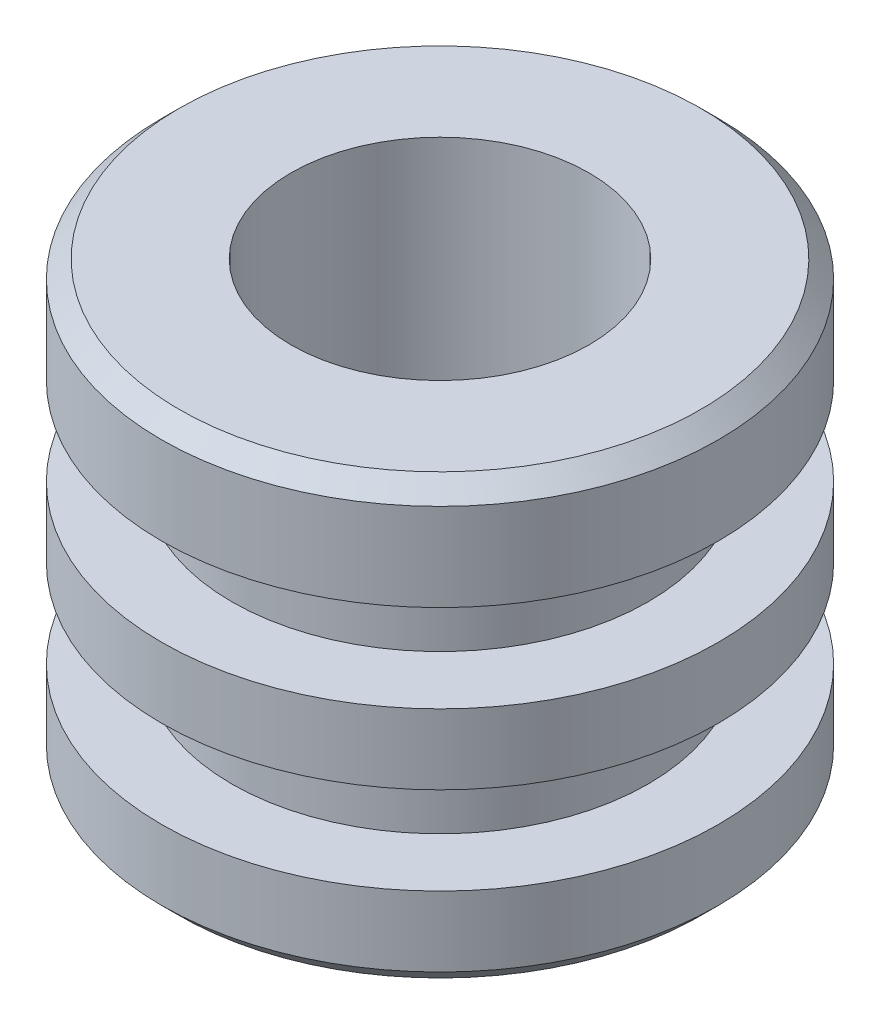
ISO-10303-21;
HEADER;
FILE_DESCRIPTION(('STEP AP214'),'2;1');
FILE_NAME('part.step','',(''),(''),'','','');
FILE_SCHEMA(('AUTOMOTIVE_DESIGN { 1 0 10303 214 1 1 1 1 }'));
ENDSEC;
DATA;
#1=APPLICATION_CONTEXT('core data for automotive mechanical design processes');
#2=APPLICATION_PROTOCOL_DEFINITION('international standard','automotive_design',2000,#1);
#3=PRODUCT_CONTEXT('',#1,'mechanical');
#4=PRODUCT('Part','Part','',(#3));
#5=PRODUCT_RELATED_PRODUCT_CATEGORY('part','',(#4));
#6=PRODUCT_DEFINITION_FORMATION('','',#4);
#7=PRODUCT_DEFINITION_CONTEXT('part definition',#1,'design');
#8=PRODUCT_DEFINITION('design','',#6,#7);
#9=PRODUCT_DEFINITION_SHAPE('','',#8);
#10=(LENGTH_UNIT() NAMED_UNIT(*) SI_UNIT(.MILLI.,.METRE.));
#11=(NAMED_UNIT(*) PLANE_ANGLE_UNIT() SI_UNIT($,.RADIAN.));
#12=(NAMED_UNIT(*) SI_UNIT($,.STERADIAN.) SOLID_ANGLE_UNIT());
#13=UNCERTAINTY_MEASURE_WITH_UNIT(LENGTH_MEASURE(1.E-05),#10,'distance_accuracy_value','');
#14=(GEOMETRIC_REPRESENTATION_CONTEXT(3) GLOBAL_UNCERTAINTY_ASSIGNED_CONTEXT((#13)) GLOBAL_UNIT_ASSIGNED_CONTEXT((#10,
#11,#12)) REPRESENTATION_CONTEXT('',''));
#15=CARTESIAN_POINT('',(0.,0.,0.));
#16=DIRECTION('',(0.,0.,1.));
#17=DIRECTION('',(1.,0.,0.));
#18=AXIS2_PLACEMENT_3D('',#15,#16,#17);
#19=CARTESIAN_POINT('',(14.875,-10.,0.));
#20=DIRECTION('',(0.,1.,0.));
#21=DIRECTION('',(-1.,0.,0.));
#22=AXIS2_PLACEMENT_3D('',#19,#20,#21);
#23=PLANE('',#22);
#24=CARTESIAN_POINT('',(0.,-9.99999999999999,0.));
#25=DIRECTION('',(0.,1.,0.));
#26=DIRECTION('',(-1.,0.,0.));
#27=AXIS2_PLACEMENT_3D('',#24,#25,#26);
#28=CIRCLE('',#27,14.875);
#29=CARTESIAN_POINT('',(-14.875,-9.99999999999999,0.));
#30=VERTEX_POINT('',#29);
#31=EDGE_CURVE('E83',#30,#30,#28,.T.);
#32=ORIENTED_EDGE('',*,*,#31,.F.);
#33=EDGE_LOOP('',(#32));
#34=FACE_BOUND('',#33,.T.);
#35=CARTESIAN_POINT('',(0.,-10.,0.));
#36=DIRECTION('',(0.,1.,0.));
#37=DIRECTION('',(-1.,0.,0.));
#38=AXIS2_PLACEMENT_3D('',#35,#36,#37);
#39=CIRCLE('',#38,6.50000000000003);
#40=CARTESIAN_POINT('',(-6.50000000000002,-10.,0.));
#41=VERTEX_POINT('',#40);
#42=EDGE_CURVE('E10',#41,#41,#39,.T.);
#43=ORIENTED_EDGE('',*,*,#42,.T.);
#44=EDGE_LOOP('',(#43));
#45=FACE_BOUND('',#44,.T.);
#46=ADVANCED_FACE('F31',(#34,#45),#23,.F.);
#47=CARTESIAN_POINT('',(0.,22.6861837037085,0.));
#48=DIRECTION('',(0.,1.,0.));
#49=DIRECTION('',(-1.,0.,0.));
#50=AXIS2_PLACEMENT_3D('',#47,#48,#49);
#51=CYLINDRICAL_SURFACE('',#50,6.50000000000002);
#52=ORIENTED_EDGE('',*,*,#42,.F.);
#53=EDGE_LOOP('',(#52));
#54=FACE_BOUND('',#53,.T.);
#55=CARTESIAN_POINT('',(0.,-0.5,0.));
#56=DIRECTION('',(0.,1.,0.));
#57=DIRECTION('',(-1.,0.,0.));
#58=AXIS2_PLACEMENT_3D('',#55,#56,#57);
#59=CIRCLE('',#58,6.50000000000002);
#60=CARTESIAN_POINT('',(-6.50000000000001,-0.499999999999999,0.));
#61=VERTEX_POINT('',#60);
#62=EDGE_CURVE('E37',#61,#61,#59,.T.);
#63=ORIENTED_EDGE('',*,*,#62,.T.);
#64=EDGE_LOOP('',(#63));
#65=FACE_BOUND('',#64,.T.);
#66=ADVANCED_FACE('F90',(#54,#65),#51,.F.);
#67=CARTESIAN_POINT('',(6.50000000000004,-0.5,0.));
#68=DIRECTION('',(0.,-1.,0.));
#69=DIRECTION('',(1.,0.,0.));
#70=AXIS2_PLACEMENT_3D('',#67,#68,#69);
#71=PLANE('',#70);
#72=ORIENTED_EDGE('',*,*,#62,.F.);
#73=EDGE_LOOP('',(#72));
#74=FACE_BOUND('',#73,.T.);
#75=CARTESIAN_POINT('',(0.,-0.5,0.));
#76=DIRECTION('',(0.,1.,0.));
#77=DIRECTION('',(-1.,0.,0.));
#78=AXIS2_PLACEMENT_3D('',#75,#76,#77);
#79=CIRCLE('',#78,8.49999999999998);
#80=CARTESIAN_POINT('',(-8.49999999999997,-0.499999999999999,0.));
#81=VERTEX_POINT('',#80);
#82=EDGE_CURVE('E41',#81,#81,#79,.T.);
#83=ORIENTED_EDGE('',*,*,#82,.T.);
#84=EDGE_LOOP('',(#83));
#85=FACE_BOUND('',#84,.T.);
#86=ADVANCED_FACE('F94',(#74,#85),#71,.F.);
#87=CARTESIAN_POINT('',(0.,22.6861837037085,0.));
#88=DIRECTION('',(0.,1.,0.));
#89=DIRECTION('',(-1.,0.,0.));
#90=AXIS2_PLACEMENT_3D('',#87,#88,#89);
#91=CYLINDRICAL_SURFACE('',#90,8.49999999999998);
#92=ORIENTED_EDGE('',*,*,#82,.F.);
#93=EDGE_LOOP('',(#92));
#94=FACE_BOUND('',#93,.T.);
#95=CARTESIAN_POINT('',(0.,15.,0.));
#96=DIRECTION('',(0.,1.,0.));
#97=DIRECTION('',(-1.,0.,0.));
#98=AXIS2_PLACEMENT_3D('',#95,#96,#97);
#99=CIRCLE('',#98,8.49999999999998);
#100=CARTESIAN_POINT('',(-8.49999999999997,15.,0.));
#101=VERTEX_POINT('',#100);
#102=EDGE_CURVE('E45',#101,#101,#99,.T.);
#103=ORIENTED_EDGE('',*,*,#102,.T.);
#104=EDGE_LOOP('',(#103));
#105=FACE_BOUND('',#104,.T.);
#106=ADVANCED_FACE('F99',(#94,#105),#91,.F.);
#107=CARTESIAN_POINT('',(8.49999999999999,15.,0.));
#108=DIRECTION('',(0.,-1.,0.));
#109=DIRECTION('',(1.,0.,0.));
#110=AXIS2_PLACEMENT_3D('',#107,#108,#109);
#111=PLANE('',#110);
#112=ORIENTED_EDGE('',*,*,#102,.F.);
#113=EDGE_LOOP('',(#112));
#114=FACE_BOUND('',#113,.T.);
#115=CARTESIAN_POINT('',(0.,15.,0.));
#116=DIRECTION('',(0.,1.,0.));
#117=DIRECTION('',(-1.,0.,0.));
#118=AXIS2_PLACEMENT_3D('',#115,#116,#117);
#119=CIRCLE('',#118,14.875);
#120=CARTESIAN_POINT('',(-14.875,15.,0.));
#121=VERTEX_POINT('',#120);
#122=EDGE_CURVE('E50',#121,#121,#119,.T.);
#123=ORIENTED_EDGE('',*,*,#122,.T.);
#124=EDGE_LOOP('',(#123));
#125=FACE_BOUND('',#124,.T.);
#126=ADVANCED_FACE('F105',(#114,#125),#111,.F.);
#127=CARTESIAN_POINT('',(0.,14.,0.));
#128=DIRECTION('',(0.,-1.,0.));
#129=DIRECTION('',(1.,0.,0.));
#130=AXIS2_PLACEMENT_3D('',#127,#128,#129);
#131=CONICAL_SURFACE('',#130,15.875,0.785398163397451);
#132=ORIENTED_EDGE('',*,*,#122,.F.);
#133=EDGE_LOOP('',(#132));
#134=FACE_BOUND('',#133,.T.);
#135=CARTESIAN_POINT('',(0.,14.,0.));
#136=DIRECTION('',(0.,1.,0.));
#137=DIRECTION('',(-1.,0.,0.));
#138=AXIS2_PLACEMENT_3D('',#135,#136,#137);
#139=CIRCLE('',#138,15.875);
#140=CARTESIAN_POINT('',(-15.875,14.,0.));
#141=VERTEX_POINT('',#140);
#142=EDGE_CURVE('E53',#141,#141,#139,.T.);
#143=ORIENTED_EDGE('',*,*,#142,.T.);
#144=EDGE_LOOP('',(#143));
#145=FACE_BOUND('',#144,.T.);
#146=ADVANCED_FACE('F109',(#134,#145),#131,.T.);
#147=CARTESIAN_POINT('',(0.,22.6861837037085,0.));
#148=DIRECTION('',(0.,1.,0.));
#149=DIRECTION('',(-1.,0.,0.));
#150=AXIS2_PLACEMENT_3D('',#147,#148,#149);
#151=CYLINDRICAL_SURFACE('',#150,15.8749999999999);
#152=ORIENTED_EDGE('',*,*,#142,.F.);
#153=EDGE_LOOP('',(#152));
#154=FACE_BOUND('',#153,.T.);
#155=CARTESIAN_POINT('',(0.,9.,0.));
#156=DIRECTION('',(0.,1.,0.));
#157=DIRECTION('',(-1.,0.,0.));
#158=AXIS2_PLACEMENT_3D('',#155,#156,#157);
#159=CIRCLE('',#158,15.8749999999998);
#160=CARTESIAN_POINT('',(-15.8749999999998,9.,0.));
#161=VERTEX_POINT('',#160);
#162=EDGE_CURVE('E56',#161,#161,#159,.T.);
#163=ORIENTED_EDGE('',*,*,#162,.T.);
#164=EDGE_LOOP('',(#163));
#165=FACE_BOUND('',#164,.T.);
#166=ADVANCED_FACE('F113',(#154,#165),#151,.T.);
#167=CARTESIAN_POINT('',(15.8749999999998,9.,0.));
#168=DIRECTION('',(0.,1.,0.));
#169=DIRECTION('',(-1.,0.,0.));
#170=AXIS2_PLACEMENT_3D('',#167,#168,#169);
#171=PLANE('',#170);
#172=ORIENTED_EDGE('',*,*,#162,.F.);
#173=EDGE_LOOP('',(#172));
#174=FACE_BOUND('',#173,.T.);
#175=CARTESIAN_POINT('',(0.,9.,0.));
#176=DIRECTION('',(0.,1.,0.));
#177=DIRECTION('',(-1.,0.,0.));
#178=AXIS2_PLACEMENT_3D('',#175,#176,#177);
#179=CIRCLE('',#178,11.8749999999998);
#180=CARTESIAN_POINT('',(-11.8749999999998,9.,0.));
#181=VERTEX_POINT('',#180);
#182=EDGE_CURVE('E59',#181,#181,#179,.T.);
#183=ORIENTED_EDGE('',*,*,#182,.T.);
#184=EDGE_LOOP('',(#183));
#185=FACE_BOUND('',#184,.T.);
#186=ADVANCED_FACE('F117',(#174,#185),#171,.F.);
#187=CARTESIAN_POINT('',(0.,22.6861837037085,0.));
#188=DIRECTION('',(0.,1.,0.));
#189=DIRECTION('',(-1.,0.,0.));
#190=AXIS2_PLACEMENT_3D('',#187,#188,#189);
#191=CYLINDRICAL_SURFACE('',#190,11.8749999999998);
#192=ORIENTED_EDGE('',*,*,#182,.F.);
#193=EDGE_LOOP('',(#192));
#194=FACE_BOUND('',#193,.T.);
#195=CARTESIAN_POINT('',(0.,4.,0.));
#196=DIRECTION('',(0.,1.,0.));
#197=DIRECTION('',(-1.,0.,0.));
#198=AXIS2_PLACEMENT_3D('',#195,#196,#197);
#199=CIRCLE('',#198,11.8749999999998);
#200=CARTESIAN_POINT('',(-11.8749999999998,4.,0.));
#201=VERTEX_POINT('',#200);
#202=EDGE_CURVE('E62',#201,#201,#199,.T.);
#203=ORIENTED_EDGE('',*,*,#202,.T.);
#204=EDGE_LOOP('',(#203));
#205=FACE_BOUND('',#204,.T.);
#206=ADVANCED_FACE('F121',(#194,#205),#191,.T.);
#207=CARTESIAN_POINT('',(11.8749999999998,4.,0.));
#208=DIRECTION('',(0.,-1.,0.));
#209=DIRECTION('',(1.,0.,0.));
#210=AXIS2_PLACEMENT_3D('',#207,#208,#209);
#211=PLANE('',#210);
#212=ORIENTED_EDGE('',*,*,#202,.F.);
#213=EDGE_LOOP('',(#212));
#214=FACE_BOUND('',#213,.T.);
#215=CARTESIAN_POINT('',(0.,4.,0.));
#216=DIRECTION('',(0.,1.,0.));
#217=DIRECTION('',(-1.,0.,0.));
#218=AXIS2_PLACEMENT_3D('',#215,#216,#217);
#219=CIRCLE('',#218,15.8749999999998);
#220=CARTESIAN_POINT('',(-15.8749999999998,4.,0.));
#221=VERTEX_POINT('',#220);
#222=EDGE_CURVE('E65',#221,#221,#219,.T.);
#223=ORIENTED_EDGE('',*,*,#222,.T.);
#224=EDGE_LOOP('',(#223));
#225=FACE_BOUND('',#224,.T.);
#226=ADVANCED_FACE('F125',(#214,#225),#211,.F.);
#227=CARTESIAN_POINT('',(0.,22.6861837037085,0.));
#228=DIRECTION('',(0.,1.,0.));
#229=DIRECTION('',(-1.,0.,0.));
#230=AXIS2_PLACEMENT_3D('',#227,#228,#229);
#231=CYLINDRICAL_SURFACE('',#230,15.8749999999999);
#232=ORIENTED_EDGE('',*,*,#222,.F.);
#233=EDGE_LOOP('',(#232));
#234=FACE_BOUND('',#233,.T.);
#235=CARTESIAN_POINT('',(0.,0.,0.));
#236=DIRECTION('',(0.,1.,0.));
#237=DIRECTION('',(-1.,0.,0.));
#238=AXIS2_PLACEMENT_3D('',#235,#236,#237);
#239=CIRCLE('',#238,15.875);
#240=CARTESIAN_POINT('',(-15.875,0.,0.));
#241=VERTEX_POINT('',#240);
#242=EDGE_CURVE('E68',#241,#241,#239,.T.);
#243=ORIENTED_EDGE('',*,*,#242,.T.);
#244=EDGE_LOOP('',(#243));
#245=FACE_BOUND('',#244,.T.);
#246=ADVANCED_FACE('F129',(#234,#245),#231,.T.);
#247=CARTESIAN_POINT('',(15.875,0.,0.));
#248=DIRECTION('',(0.,1.,0.));
#249=DIRECTION('',(-1.,0.,0.));
#250=AXIS2_PLACEMENT_3D('',#247,#248,#249);
#251=PLANE('',#250);
#252=ORIENTED_EDGE('',*,*,#242,.F.);
#253=EDGE_LOOP('',(#252));
#254=FACE_BOUND('',#253,.T.);
#255=CARTESIAN_POINT('',(0.,0.,0.));
#256=DIRECTION('',(0.,1.,0.));
#257=DIRECTION('',(-1.,0.,0.));
#258=AXIS2_PLACEMENT_3D('',#255,#256,#257);
#259=CIRCLE('',#258,11.875);
#260=CARTESIAN_POINT('',(-11.875,0.,0.));
#261=VERTEX_POINT('',#260);
#262=EDGE_CURVE('E71',#261,#261,#259,.T.);
#263=ORIENTED_EDGE('',*,*,#262,.T.);
#264=EDGE_LOOP('',(#263));
#265=FACE_BOUND('',#264,.T.);
#266=ADVANCED_FACE('F133',(#254,#265),#251,.F.);
#267=CARTESIAN_POINT('',(0.,22.6861837037085,0.));
#268=DIRECTION('',(0.,1.,0.));
#269=DIRECTION('',(-1.,0.,0.));
#270=AXIS2_PLACEMENT_3D('',#267,#268,#269);
#271=CYLINDRICAL_SURFACE('',#270,11.875);
#272=ORIENTED_EDGE('',*,*,#262,.F.);
#273=EDGE_LOOP('',(#272));
#274=FACE_BOUND('',#273,.T.);
#275=CARTESIAN_POINT('',(0.,-4.99999999999999,0.));
#276=DIRECTION('',(0.,1.,0.));
#277=DIRECTION('',(-1.,0.,0.));
#278=AXIS2_PLACEMENT_3D('',#275,#276,#277);
#279=CIRCLE('',#278,11.875);
#280=CARTESIAN_POINT('',(-11.875,-4.99999999999999,0.));
#281=VERTEX_POINT('',#280);
#282=EDGE_CURVE('E74',#281,#281,#279,.T.);
#283=ORIENTED_EDGE('',*,*,#282,.T.);
#284=EDGE_LOOP('',(#283));
#285=FACE_BOUND('',#284,.T.);
#286=ADVANCED_FACE('F137',(#274,#285),#271,.T.);
#287=CARTESIAN_POINT('',(11.875,-5.,0.));
#288=DIRECTION('',(0.,-1.,0.));
#289=DIRECTION('',(1.,0.,0.));
#290=AXIS2_PLACEMENT_3D('',#287,#288,#289);
#291=PLANE('',#290);
#292=ORIENTED_EDGE('',*,*,#282,.F.);
#293=EDGE_LOOP('',(#292));
#294=FACE_BOUND('',#293,.T.);
#295=CARTESIAN_POINT('',(0.,-4.99999999999999,0.));
#296=DIRECTION('',(0.,1.,0.));
#297=DIRECTION('',(-1.,0.,0.));
#298=AXIS2_PLACEMENT_3D('',#295,#296,#297);
#299=CIRCLE('',#298,15.875);
#300=CARTESIAN_POINT('',(-15.875,-4.99999999999999,0.));
#301=VERTEX_POINT('',#300);
#302=EDGE_CURVE('E77',#301,#301,#299,.T.);
#303=ORIENTED_EDGE('',*,*,#302,.T.);
#304=EDGE_LOOP('',(#303));
#305=FACE_BOUND('',#304,.T.);
#306=ADVANCED_FACE('F141',(#294,#305),#291,.F.);
#307=CARTESIAN_POINT('',(0.,22.6861837037085,0.));
#308=DIRECTION('',(0.,1.,0.));
#309=DIRECTION('',(-1.,0.,0.));
#310=AXIS2_PLACEMENT_3D('',#307,#308,#309);
#311=CYLINDRICAL_SURFACE('',#310,15.875);
#312=ORIENTED_EDGE('',*,*,#302,.F.);
#313=EDGE_LOOP('',(#312));
#314=FACE_BOUND('',#313,.T.);
#315=CARTESIAN_POINT('',(0.,-8.99999999999999,0.));
#316=DIRECTION('',(0.,1.,0.));
#317=DIRECTION('',(-1.,0.,0.));
#318=AXIS2_PLACEMENT_3D('',#315,#316,#317);
#319=CIRCLE('',#318,15.875);
#320=CARTESIAN_POINT('',(-15.875,-8.99999999999999,0.));
#321=VERTEX_POINT('',#320);
#322=EDGE_CURVE('E80',#321,#321,#319,.T.);
#323=ORIENTED_EDGE('',*,*,#322,.T.);
#324=EDGE_LOOP('',(#323));
#325=FACE_BOUND('',#324,.T.);
#326=ADVANCED_FACE('F145',(#314,#325),#311,.T.);
#327=CARTESIAN_POINT('',(0.,-9.99999999999999,0.));
#328=DIRECTION('',(0.,1.,0.));
#329=DIRECTION('',(-1.,0.,0.));
#330=AXIS2_PLACEMENT_3D('',#327,#328,#329);
#331=CONICAL_SURFACE('',#330,14.875,0.785398163397449);
#332=ORIENTED_EDGE('',*,*,#322,.F.);
#333=EDGE_LOOP('',(#332));
#334=FACE_BOUND('',#333,.T.);
#335=ORIENTED_EDGE('',*,*,#31,.T.);
#336=EDGE_LOOP('',(#335));
#337=FACE_BOUND('',#336,.T.);
#338=ADVANCED_FACE('F87',(#334,#337),#331,.T.);
#339=CLOSED_SHELL('',(#46,#66,#86,#106,#126,#146,#166,#186,#206,#226,#246,#266,#286,#306,#326,#338));
#340=MANIFOLD_SOLID_BREP('B2',#339);
#341=ADVANCED_BREP_SHAPE_REPRESENTATION('',(#18,#340),#14);
#342=SHAPE_DEFINITION_REPRESENTATION(#9,#341);
ENDSEC;
END-ISO-10303-21;
